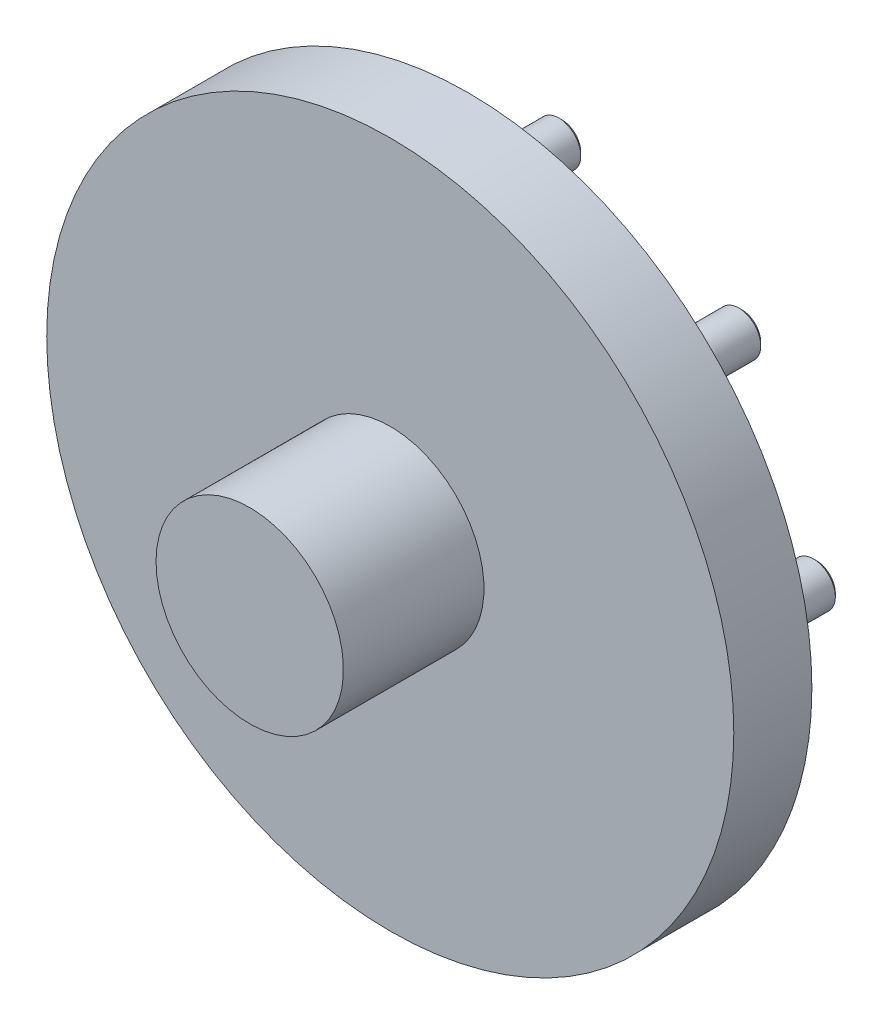
ISO-10303-21;
HEADER;
FILE_DESCRIPTION(('STEP AP214'),'2;1');
FILE_NAME('part.step','',(''),(''),'','','');
FILE_SCHEMA(('AUTOMOTIVE_DESIGN { 1 0 10303 214 1 1 1 1 }'));
ENDSEC;
DATA;
#1=APPLICATION_CONTEXT('core data for automotive mechanical design processes');
#2=APPLICATION_PROTOCOL_DEFINITION('international standard','automotive_design',2000,#1);
#3=PRODUCT_CONTEXT('',#1,'mechanical');
#4=PRODUCT('Part','Part','',(#3));
#5=PRODUCT_RELATED_PRODUCT_CATEGORY('part','',(#4));
#6=PRODUCT_DEFINITION_FORMATION('','',#4);
#7=PRODUCT_DEFINITION_CONTEXT('part definition',#1,'design');
#8=PRODUCT_DEFINITION('design','',#6,#7);
#9=PRODUCT_DEFINITION_SHAPE('','',#8);
#10=(LENGTH_UNIT() NAMED_UNIT(*) SI_UNIT(.MILLI.,.METRE.));
#11=(NAMED_UNIT(*) PLANE_ANGLE_UNIT() SI_UNIT($,.RADIAN.));
#12=(NAMED_UNIT(*) SI_UNIT($,.STERADIAN.) SOLID_ANGLE_UNIT());
#13=UNCERTAINTY_MEASURE_WITH_UNIT(LENGTH_MEASURE(1.E-05),#10,'distance_accuracy_value','');
#14=(GEOMETRIC_REPRESENTATION_CONTEXT(3) GLOBAL_UNCERTAINTY_ASSIGNED_CONTEXT((#13)) GLOBAL_UNIT_ASSIGNED_CONTEXT((#10,
#11,#12)) REPRESENTATION_CONTEXT('',''));
#15=CARTESIAN_POINT('',(0.,0.,0.));
#16=DIRECTION('',(0.,0.,1.));
#17=DIRECTION('',(1.,0.,0.));
#18=AXIS2_PLACEMENT_3D('',#15,#16,#17);
#19=CARTESIAN_POINT('',(53.,0.,4.99999999999995));
#20=DIRECTION('',(0.,0.,-1.));
#21=DIRECTION('',(-1.,0.,0.));
#22=AXIS2_PLACEMENT_3D('',#19,#20,#21);
#23=PLANE('',#22);
#24=CARTESIAN_POINT('',(-81.5,0.,4.99999999999995));
#25=DIRECTION('',(0.,0.,-1.));
#26=DIRECTION('',(-1.,0.,0.));
#27=AXIS2_PLACEMENT_3D('',#24,#25,#26);
#28=CIRCLE('',#27,7.);
#29=CARTESIAN_POINT('',(-88.5,0.,4.99999999999995));
#30=VERTEX_POINT('',#29);
#31=EDGE_CURVE('E124',#30,#30,#28,.T.);
#32=ORIENTED_EDGE('',*,*,#31,.F.);
#33=EDGE_LOOP('',(#32));
#34=FACE_BOUND('',#33,.T.);
#35=CARTESIAN_POINT('',(-57.6292026667036,57.6292026667036,4.99999999999995));
#36=DIRECTION('',(0.,0.,-1.));
#37=DIRECTION('',(-1.,0.,0.));
#38=AXIS2_PLACEMENT_3D('',#35,#36,#37);
#39=CIRCLE('',#38,7.00000000000002);
#40=CARTESIAN_POINT('',(-64.6292026667036,57.6292026667036,4.99999999999995));
#41=VERTEX_POINT('',#40);
#42=EDGE_CURVE('E118',#41,#41,#39,.T.);
#43=ORIENTED_EDGE('',*,*,#42,.F.);
#44=EDGE_LOOP('',(#43));
#45=FACE_BOUND('',#44,.T.);
#46=CARTESIAN_POINT('',(57.6292026667036,57.6292026667036,4.99999999999995));
#47=DIRECTION('',(0.,0.,-1.));
#48=DIRECTION('',(-1.,0.,0.));
#49=AXIS2_PLACEMENT_3D('',#46,#47,#48);
#50=CIRCLE('',#49,7.00000000000001);
#51=CARTESIAN_POINT('',(50.6292026667036,57.6292026667036,4.99999999999995));
#52=VERTEX_POINT('',#51);
#53=EDGE_CURVE('E112',#52,#52,#50,.T.);
#54=ORIENTED_EDGE('',*,*,#53,.F.);
#55=EDGE_LOOP('',(#54));
#56=FACE_BOUND('',#55,.T.);
#57=CARTESIAN_POINT('',(57.6292026667036,-57.6292026667036,4.99999999999995));
#58=DIRECTION('',(0.,0.,-1.));
#59=DIRECTION('',(-1.,0.,0.));
#60=AXIS2_PLACEMENT_3D('',#57,#58,#59);
#61=CIRCLE('',#60,7.00000000000002);
#62=CARTESIAN_POINT('',(50.6292026667036,-57.6292026667036,4.99999999999995));
#63=VERTEX_POINT('',#62);
#64=EDGE_CURVE('E106',#63,#63,#61,.T.);
#65=ORIENTED_EDGE('',*,*,#64,.F.);
#66=EDGE_LOOP('',(#65));
#67=FACE_BOUND('',#66,.T.);
#68=CARTESIAN_POINT('',(0.,0.,4.99999999999989));
#69=DIRECTION('',(0.,0.,-1.));
#70=DIRECTION('',(-1.,0.,0.));
#71=AXIS2_PLACEMENT_3D('',#68,#69,#70);
#72=CIRCLE('',#71,110.);
#73=CARTESIAN_POINT('',(-110.,0.,4.99999999999989));
#74=VERTEX_POINT('',#73);
#75=EDGE_CURVE('E97',#74,#74,#72,.T.);
#76=ORIENTED_EDGE('',*,*,#75,.T.);
#77=EDGE_LOOP('',(#76));
#78=FACE_BOUND('',#77,.T.);
#79=CARTESIAN_POINT('',(0.,0.,5.));
#80=DIRECTION('',(0.,0.,-1.));
#81=DIRECTION('',(-1.,0.,0.));
#82=AXIS2_PLACEMENT_3D('',#79,#80,#81);
#83=CIRCLE('',#82,53.);
#84=CARTESIAN_POINT('',(-53.,0.,5.));
#85=VERTEX_POINT('',#84);
#86=EDGE_CURVE('E94',#85,#85,#83,.T.);
#87=ORIENTED_EDGE('',*,*,#86,.F.);
#88=EDGE_LOOP('',(#87));
#89=FACE_BOUND('',#88,.T.);
#90=CARTESIAN_POINT('',(81.5,0.,4.99999999999995));
#91=DIRECTION('',(0.,0.,-1.));
#92=DIRECTION('',(-1.,0.,0.));
#93=AXIS2_PLACEMENT_3D('',#90,#91,#92);
#94=CIRCLE('',#93,7.);
#95=CARTESIAN_POINT('',(74.5,0.,4.99999999999995));
#96=VERTEX_POINT('',#95);
#97=EDGE_CURVE('E109',#96,#96,#94,.T.);
#98=ORIENTED_EDGE('',*,*,#97,.F.);
#99=EDGE_LOOP('',(#98));
#100=FACE_BOUND('',#99,.T.);
#101=CARTESIAN_POINT('',(0.,81.5,4.99999999999995));
#102=DIRECTION('',(0.,0.,-1.));
#103=DIRECTION('',(-1.,0.,0.));
#104=AXIS2_PLACEMENT_3D('',#101,#102,#103);
#105=CIRCLE('',#104,7.00000000000001);
#106=CARTESIAN_POINT('',(-6.99999999999999,81.5,4.99999999999995));
#107=VERTEX_POINT('',#106);
#108=EDGE_CURVE('E115',#107,#107,#105,.T.);
#109=ORIENTED_EDGE('',*,*,#108,.F.);
#110=EDGE_LOOP('',(#109));
#111=FACE_BOUND('',#110,.T.);
#112=CARTESIAN_POINT('',(0.,-81.5,4.99999999999995));
#113=DIRECTION('',(0.,0.,-1.));
#114=DIRECTION('',(-1.,0.,0.));
#115=AXIS2_PLACEMENT_3D('',#112,#113,#114);
#116=CIRCLE('',#115,7.00000000000001);
#117=CARTESIAN_POINT('',(-7.00000000000002,-81.5,4.99999999999995));
#118=VERTEX_POINT('',#117);
#119=EDGE_CURVE('E121',#118,#118,#116,.T.);
#120=ORIENTED_EDGE('',*,*,#119,.F.);
#121=EDGE_LOOP('',(#120));
#122=FACE_BOUND('',#121,.T.);
#123=CARTESIAN_POINT('',(-57.6292026667036,-57.6292026667036,4.99999999999995));
#124=DIRECTION('',(0.,0.,-1.));
#125=DIRECTION('',(-1.,0.,0.));
#126=AXIS2_PLACEMENT_3D('',#123,#124,#125);
#127=CIRCLE('',#126,7.);
#128=CARTESIAN_POINT('',(-64.6292026667036,-57.6292026667036,4.99999999999995));
#129=VERTEX_POINT('',#128);
#130=EDGE_CURVE('E127',#129,#129,#127,.T.);
#131=ORIENTED_EDGE('',*,*,#130,.F.);
#132=EDGE_LOOP('',(#131));
#133=FACE_BOUND('',#132,.T.);
#134=ADVANCED_FACE('F32',(#34,#45,#56,#67,#78,#89,#100,#111,#122,#133),#23,.T.);
#135=CARTESIAN_POINT('',(0.,0.,75.));
#136=DIRECTION('',(0.,0.,-1.));
#137=DIRECTION('',(-1.,0.,0.));
#138=AXIS2_PLACEMENT_3D('',#135,#136,#137);
#139=CYLINDRICAL_SURFACE('',#138,30.);
#140=CARTESIAN_POINT('',(0.,0.,75.));
#141=DIRECTION('',(0.,0.,-1.));
#142=DIRECTION('',(-1.,0.,0.));
#143=AXIS2_PLACEMENT_3D('',#140,#141,#142);
#144=CIRCLE('',#143,30.);
#145=CARTESIAN_POINT('',(-30.,0.,75.));
#146=VERTEX_POINT('',#145);
#147=EDGE_CURVE('E88',#146,#146,#144,.T.);
#148=ORIENTED_EDGE('',*,*,#147,.T.);
#149=EDGE_LOOP('',(#148));
#150=FACE_BOUND('',#149,.T.);
#151=CARTESIAN_POINT('',(0.,0.,29.9999999999999));
#152=DIRECTION('',(0.,0.,-1.));
#153=DIRECTION('',(-1.,0.,0.));
#154=AXIS2_PLACEMENT_3D('',#151,#152,#153);
#155=CIRCLE('',#154,30.);
#156=CARTESIAN_POINT('',(-30.,0.,29.9999999999999));
#157=VERTEX_POINT('',#156);
#158=EDGE_CURVE('E103',#157,#157,#155,.T.);
#159=ORIENTED_EDGE('',*,*,#158,.F.);
#160=EDGE_LOOP('',(#159));
#161=FACE_BOUND('',#160,.T.);
#162=ADVANCED_FACE('F134',(#150,#161),#139,.T.);
#163=CARTESIAN_POINT('',(30.,0.,75.));
#164=DIRECTION('',(0.,0.,1.));
#165=DIRECTION('',(1.,0.,0.));
#166=AXIS2_PLACEMENT_3D('',#163,#164,#165);
#167=PLANE('',#166);
#168=ORIENTED_EDGE('',*,*,#147,.F.);
#169=EDGE_LOOP('',(#168));
#170=FACE_BOUND('',#169,.T.);
#171=ADVANCED_FACE('F140',(#170),#167,.T.);
#172=CARTESIAN_POINT('',(0.,0.,0.));
#173=DIRECTION('',(0.,0.,-1.));
#174=DIRECTION('',(-1.,0.,0.));
#175=AXIS2_PLACEMENT_3D('',#172,#173,#174);
#176=PLANE('',#175);
#177=CARTESIAN_POINT('',(0.,0.,0.));
#178=DIRECTION('',(0.,0.,-1.));
#179=DIRECTION('',(-1.,0.,0.));
#180=AXIS2_PLACEMENT_3D('',#177,#178,#179);
#181=CIRCLE('',#180,53.);
#182=CARTESIAN_POINT('',(-53.,0.,0.));
#183=VERTEX_POINT('',#182);
#184=EDGE_CURVE('E91',#183,#183,#181,.T.);
#185=ORIENTED_EDGE('',*,*,#184,.T.);
#186=EDGE_LOOP('',(#185));
#187=FACE_BOUND('',#186,.T.);
#188=ADVANCED_FACE('F152',(#187),#176,.T.);
#189=CARTESIAN_POINT('',(0.,0.,75.));
#190=DIRECTION('',(0.,0.,-1.));
#191=DIRECTION('',(-1.,0.,0.));
#192=AXIS2_PLACEMENT_3D('',#189,#190,#191);
#193=CYLINDRICAL_SURFACE('',#192,53.);
#194=ORIENTED_EDGE('',*,*,#86,.T.);
#195=EDGE_LOOP('',(#194));
#196=FACE_BOUND('',#195,.T.);
#197=ORIENTED_EDGE('',*,*,#184,.F.);
#198=EDGE_LOOP('',(#197));
#199=FACE_BOUND('',#198,.T.);
#200=ADVANCED_FACE('F149',(#196,#199),#193,.T.);
#201=CARTESIAN_POINT('',(0.,0.,75.));
#202=DIRECTION('',(0.,0.,-1.));
#203=DIRECTION('',(-1.,0.,0.));
#204=AXIS2_PLACEMENT_3D('',#201,#202,#203);
#205=CYLINDRICAL_SURFACE('',#204,110.);
#206=CARTESIAN_POINT('',(0.,0.,29.9999999999999));
#207=DIRECTION('',(0.,0.,-1.));
#208=DIRECTION('',(-1.,0.,0.));
#209=AXIS2_PLACEMENT_3D('',#206,#207,#208);
#210=CIRCLE('',#209,110.);
#211=CARTESIAN_POINT('',(-110.,0.,29.9999999999999));
#212=VERTEX_POINT('',#211);
#213=EDGE_CURVE('E100',#212,#212,#210,.T.);
#214=ORIENTED_EDGE('',*,*,#213,.T.);
#215=EDGE_LOOP('',(#214));
#216=FACE_BOUND('',#215,.T.);
#217=ORIENTED_EDGE('',*,*,#75,.F.);
#218=EDGE_LOOP('',(#217));
#219=FACE_BOUND('',#218,.T.);
#220=ADVANCED_FACE('F147',(#216,#219),#205,.T.);
#221=CARTESIAN_POINT('',(110.,0.,29.9999999999999));
#222=DIRECTION('',(0.,0.,1.));
#223=DIRECTION('',(1.,0.,0.));
#224=AXIS2_PLACEMENT_3D('',#221,#222,#223);
#225=PLANE('',#224);
#226=ORIENTED_EDGE('',*,*,#158,.T.);
#227=EDGE_LOOP('',(#226));
#228=FACE_BOUND('',#227,.T.);
#229=ORIENTED_EDGE('',*,*,#213,.F.);
#230=EDGE_LOOP('',(#229));
#231=FACE_BOUND('',#230,.T.);
#232=ADVANCED_FACE('F239',(#228,#231),#225,.T.);
#233=CARTESIAN_POINT('',(57.6292026667036,-57.6292026667036,-25.));
#234=DIRECTION('',(0.,0.,1.));
#235=DIRECTION('',(1.,0.,0.));
#236=AXIS2_PLACEMENT_3D('',#233,#234,#235);
#237=CYLINDRICAL_SURFACE('',#236,7.00000000000002);
#238=CARTESIAN_POINT('',(57.6292026667036,-57.6292026667036,-24.));
#239=DIRECTION('',(0.,0.,-1.));
#240=DIRECTION('',(-1.,0.,0.));
#241=AXIS2_PLACEMENT_3D('',#238,#239,#240);
#242=CIRCLE('',#241,7.00000000000002);
#243=CARTESIAN_POINT('',(50.6292026667036,-57.6292026667036,-24.));
#244=VERTEX_POINT('',#243);
#245=EDGE_CURVE('E64',#244,#244,#242,.F.);
#246=ORIENTED_EDGE('',*,*,#245,.T.);
#247=EDGE_LOOP('',(#246));
#248=FACE_BOUND('',#247,.T.);
#249=ORIENTED_EDGE('',*,*,#64,.T.);
#250=EDGE_LOOP('',(#249));
#251=FACE_BOUND('',#250,.T.);
#252=ADVANCED_FACE('F236',(#248,#251),#237,.T.);
#253=CARTESIAN_POINT('',(57.6292026667036,-57.6292026667036,-25.));
#254=DIRECTION('',(0.,0.,-1.));
#255=DIRECTION('',(-1.,0.,0.));
#256=AXIS2_PLACEMENT_3D('',#253,#254,#255);
#257=PLANE('',#256);
#258=CARTESIAN_POINT('',(57.6292026667036,-57.6292026667036,-25.));
#259=DIRECTION('',(0.,0.,-1.));
#260=DIRECTION('',(-1.,0.,0.));
#261=AXIS2_PLACEMENT_3D('',#258,#259,#260);
#262=CIRCLE('',#261,5.99999999999997);
#263=CARTESIAN_POINT('',(51.6292026667036,-57.6292026667036,-25.));
#264=VERTEX_POINT('',#263);
#265=EDGE_CURVE('E67',#264,#264,#262,.T.);
#266=ORIENTED_EDGE('',*,*,#265,.T.);
#267=EDGE_LOOP('',(#266));
#268=FACE_BOUND('',#267,.T.);
#269=ADVANCED_FACE('F232',(#268),#257,.T.);
#270=CARTESIAN_POINT('',(81.5,0.,-25.));
#271=DIRECTION('',(0.,0.,1.));
#272=DIRECTION('',(1.,0.,0.));
#273=AXIS2_PLACEMENT_3D('',#270,#271,#272);
#274=CYLINDRICAL_SURFACE('',#273,7.);
#275=CARTESIAN_POINT('',(81.5,0.,-24.));
#276=DIRECTION('',(0.,0.,-1.));
#277=DIRECTION('',(-1.,0.,0.));
#278=AXIS2_PLACEMENT_3D('',#275,#276,#277);
#279=CIRCLE('',#278,7.);
#280=CARTESIAN_POINT('',(74.5,0.,-24.));
#281=VERTEX_POINT('',#280);
#282=EDGE_CURVE('E70',#281,#281,#279,.F.);
#283=ORIENTED_EDGE('',*,*,#282,.T.);
#284=EDGE_LOOP('',(#283));
#285=FACE_BOUND('',#284,.T.);
#286=ORIENTED_EDGE('',*,*,#97,.T.);
#287=EDGE_LOOP('',(#286));
#288=FACE_BOUND('',#287,.T.);
#289=ADVANCED_FACE('F228',(#285,#288),#274,.T.);
#290=CARTESIAN_POINT('',(81.5,0.,-25.));
#291=DIRECTION('',(0.,0.,-1.));
#292=DIRECTION('',(-1.,0.,0.));
#293=AXIS2_PLACEMENT_3D('',#290,#291,#292);
#294=PLANE('',#293);
#295=CARTESIAN_POINT('',(81.5,0.,-25.));
#296=DIRECTION('',(0.,0.,-1.));
#297=DIRECTION('',(-1.,0.,0.));
#298=AXIS2_PLACEMENT_3D('',#295,#296,#297);
#299=CIRCLE('',#298,5.99999999999998);
#300=CARTESIAN_POINT('',(75.5,0.,-25.));
#301=VERTEX_POINT('',#300);
#302=EDGE_CURVE('E73',#301,#301,#299,.T.);
#303=ORIENTED_EDGE('',*,*,#302,.T.);
#304=EDGE_LOOP('',(#303));
#305=FACE_BOUND('',#304,.T.);
#306=ADVANCED_FACE('F224',(#305),#294,.T.);
#307=CARTESIAN_POINT('',(57.6292026667036,57.6292026667036,-25.));
#308=DIRECTION('',(0.,0.,1.));
#309=DIRECTION('',(1.,0.,0.));
#310=AXIS2_PLACEMENT_3D('',#307,#308,#309);
#311=CYLINDRICAL_SURFACE('',#310,7.00000000000001);
#312=CARTESIAN_POINT('',(57.6292026667036,57.6292026667036,-24.));
#313=DIRECTION('',(0.,0.,-1.));
#314=DIRECTION('',(-1.,0.,0.));
#315=AXIS2_PLACEMENT_3D('',#312,#313,#314);
#316=CIRCLE('',#315,7.00000000000001);
#317=CARTESIAN_POINT('',(50.6292026667036,57.6292026667036,-24.));
#318=VERTEX_POINT('',#317);
#319=EDGE_CURVE('E76',#318,#318,#316,.F.);
#320=ORIENTED_EDGE('',*,*,#319,.T.);
#321=EDGE_LOOP('',(#320));
#322=FACE_BOUND('',#321,.T.);
#323=ORIENTED_EDGE('',*,*,#53,.T.);
#324=EDGE_LOOP('',(#323));
#325=FACE_BOUND('',#324,.T.);
#326=ADVANCED_FACE('F220',(#322,#325),#311,.T.);
#327=CARTESIAN_POINT('',(57.6292026667036,57.6292026667036,-25.));
#328=DIRECTION('',(0.,0.,-1.));
#329=DIRECTION('',(-1.,0.,0.));
#330=AXIS2_PLACEMENT_3D('',#327,#328,#329);
#331=PLANE('',#330);
#332=CARTESIAN_POINT('',(57.6292026667036,57.6292026667036,-25.));
#333=DIRECTION('',(0.,0.,-1.));
#334=DIRECTION('',(-1.,0.,0.));
#335=AXIS2_PLACEMENT_3D('',#332,#333,#334);
#336=CIRCLE('',#335,5.99999999999998);
#337=CARTESIAN_POINT('',(51.6292026667037,57.6292026667036,-25.));
#338=VERTEX_POINT('',#337);
#339=EDGE_CURVE('E79',#338,#338,#336,.T.);
#340=ORIENTED_EDGE('',*,*,#339,.T.);
#341=EDGE_LOOP('',(#340));
#342=FACE_BOUND('',#341,.T.);
#343=ADVANCED_FACE('F217',(#342),#331,.T.);
#344=CARTESIAN_POINT('',(0.,81.5,-25.));
#345=DIRECTION('',(0.,0.,1.));
#346=DIRECTION('',(1.,0.,0.));
#347=AXIS2_PLACEMENT_3D('',#344,#345,#346);
#348=CYLINDRICAL_SURFACE('',#347,7.00000000000001);
#349=CARTESIAN_POINT('',(0.,81.5,-24.));
#350=DIRECTION('',(0.,0.,-1.));
#351=DIRECTION('',(-1.,0.,0.));
#352=AXIS2_PLACEMENT_3D('',#349,#350,#351);
#353=CIRCLE('',#352,7.00000000000001);
#354=CARTESIAN_POINT('',(-6.99999999999999,81.5,-24.));
#355=VERTEX_POINT('',#354);
#356=EDGE_CURVE('E10',#355,#355,#353,.F.);
#357=ORIENTED_EDGE('',*,*,#356,.T.);
#358=EDGE_LOOP('',(#357));
#359=FACE_BOUND('',#358,.T.);
#360=ORIENTED_EDGE('',*,*,#108,.T.);
#361=EDGE_LOOP('',(#360));
#362=FACE_BOUND('',#361,.T.);
#363=ADVANCED_FACE('F214',(#359,#362),#348,.T.);
#364=CARTESIAN_POINT('',(0.,81.5,-25.));
#365=DIRECTION('',(0.,0.,-1.));
#366=DIRECTION('',(-1.,0.,0.));
#367=AXIS2_PLACEMENT_3D('',#364,#365,#366);
#368=PLANE('',#367);
#369=CARTESIAN_POINT('',(0.,81.5,-25.));
#370=DIRECTION('',(0.,0.,-1.));
#371=DIRECTION('',(-1.,0.,0.));
#372=AXIS2_PLACEMENT_3D('',#369,#370,#371);
#373=CIRCLE('',#372,5.99999999999998);
#374=CARTESIAN_POINT('',(-5.99999999999995,81.5,-25.));
#375=VERTEX_POINT('',#374);
#376=EDGE_CURVE('E39',#375,#375,#373,.T.);
#377=ORIENTED_EDGE('',*,*,#376,.T.);
#378=EDGE_LOOP('',(#377));
#379=FACE_BOUND('',#378,.T.);
#380=ADVANCED_FACE('F207',(#379),#368,.T.);
#381=CARTESIAN_POINT('',(-57.6292026667036,57.6292026667036,-25.));
#382=DIRECTION('',(0.,0.,1.));
#383=DIRECTION('',(1.,0.,0.));
#384=AXIS2_PLACEMENT_3D('',#381,#382,#383);
#385=CYLINDRICAL_SURFACE('',#384,7.00000000000002);
#386=CARTESIAN_POINT('',(-57.6292026667036,57.6292026667036,-24.));
#387=DIRECTION('',(0.,0.,-1.));
#388=DIRECTION('',(-1.,0.,0.));
#389=AXIS2_PLACEMENT_3D('',#386,#387,#388);
#390=CIRCLE('',#389,7.00000000000002);
#391=CARTESIAN_POINT('',(-64.6292026667036,57.6292026667036,-24.));
#392=VERTEX_POINT('',#391);
#393=EDGE_CURVE('E43',#392,#392,#390,.F.);
#394=ORIENTED_EDGE('',*,*,#393,.T.);
#395=EDGE_LOOP('',(#394));
#396=FACE_BOUND('',#395,.T.);
#397=ORIENTED_EDGE('',*,*,#42,.T.);
#398=EDGE_LOOP('',(#397));
#399=FACE_BOUND('',#398,.T.);
#400=ADVANCED_FACE('F198',(#396,#399),#385,.T.);
#401=CARTESIAN_POINT('',(-57.6292026667036,57.6292026667036,-25.));
#402=DIRECTION('',(0.,0.,-1.));
#403=DIRECTION('',(-1.,0.,0.));
#404=AXIS2_PLACEMENT_3D('',#401,#402,#403);
#405=PLANE('',#404);
#406=CARTESIAN_POINT('',(-57.6292026667036,57.6292026667036,-25.));
#407=DIRECTION('',(0.,0.,-1.));
#408=DIRECTION('',(-1.,0.,0.));
#409=AXIS2_PLACEMENT_3D('',#406,#407,#408);
#410=CIRCLE('',#409,5.99999999999996);
#411=CARTESIAN_POINT('',(-63.6292026667036,57.6292026667036,-25.));
#412=VERTEX_POINT('',#411);
#413=EDGE_CURVE('E47',#412,#412,#410,.T.);
#414=ORIENTED_EDGE('',*,*,#413,.T.);
#415=EDGE_LOOP('',(#414));
#416=FACE_BOUND('',#415,.T.);
#417=ADVANCED_FACE('F195',(#416),#405,.T.);
#418=CARTESIAN_POINT('',(0.,-81.5,-25.));
#419=DIRECTION('',(0.,0.,1.));
#420=DIRECTION('',(1.,0.,0.));
#421=AXIS2_PLACEMENT_3D('',#418,#419,#420);
#422=CYLINDRICAL_SURFACE('',#421,7.00000000000001);
#423=CARTESIAN_POINT('',(0.,-81.5,-24.));
#424=DIRECTION('',(0.,0.,-1.));
#425=DIRECTION('',(-1.,0.,0.));
#426=AXIS2_PLACEMENT_3D('',#423,#424,#425);
#427=CIRCLE('',#426,7.00000000000001);
#428=CARTESIAN_POINT('',(-7.00000000000002,-81.5,-24.));
#429=VERTEX_POINT('',#428);
#430=EDGE_CURVE('E58',#429,#429,#427,.F.);
#431=ORIENTED_EDGE('',*,*,#430,.T.);
#432=EDGE_LOOP('',(#431));
#433=FACE_BOUND('',#432,.T.);
#434=ORIENTED_EDGE('',*,*,#119,.T.);
#435=EDGE_LOOP('',(#434));
#436=FACE_BOUND('',#435,.T.);
#437=ADVANCED_FACE('F197',(#433,#436),#422,.T.);
#438=CARTESIAN_POINT('',(0.,-81.5,-25.));
#439=DIRECTION('',(0.,0.,-1.));
#440=DIRECTION('',(-1.,0.,0.));
#441=AXIS2_PLACEMENT_3D('',#438,#439,#440);
#442=PLANE('',#441);
#443=CARTESIAN_POINT('',(0.,-81.5,-25.));
#444=DIRECTION('',(0.,0.,-1.));
#445=DIRECTION('',(-1.,0.,0.));
#446=AXIS2_PLACEMENT_3D('',#443,#444,#445);
#447=CIRCLE('',#446,5.99999999999998);
#448=CARTESIAN_POINT('',(-5.99999999999999,-81.5,-25.));
#449=VERTEX_POINT('',#448);
#450=EDGE_CURVE('E61',#449,#449,#447,.T.);
#451=ORIENTED_EDGE('',*,*,#450,.T.);
#452=EDGE_LOOP('',(#451));
#453=FACE_BOUND('',#452,.T.);
#454=ADVANCED_FACE('F204',(#453),#442,.T.);
#455=CARTESIAN_POINT('',(-81.5,0.,-25.));
#456=DIRECTION('',(0.,0.,1.));
#457=DIRECTION('',(1.,0.,0.));
#458=AXIS2_PLACEMENT_3D('',#455,#456,#457);
#459=CYLINDRICAL_SURFACE('',#458,7.);
#460=CARTESIAN_POINT('',(-81.5,0.,-24.));
#461=DIRECTION('',(0.,0.,-1.));
#462=DIRECTION('',(-1.,0.,0.));
#463=AXIS2_PLACEMENT_3D('',#460,#461,#462);
#464=CIRCLE('',#463,7.);
#465=CARTESIAN_POINT('',(-88.5,0.,-24.));
#466=VERTEX_POINT('',#465);
#467=EDGE_CURVE('E82',#466,#466,#464,.F.);
#468=ORIENTED_EDGE('',*,*,#467,.T.);
#469=EDGE_LOOP('',(#468));
#470=FACE_BOUND('',#469,.T.);
#471=ORIENTED_EDGE('',*,*,#31,.T.);
#472=EDGE_LOOP('',(#471));
#473=FACE_BOUND('',#472,.T.);
#474=ADVANCED_FACE('F365',(#470,#473),#459,.T.);
#475=CARTESIAN_POINT('',(-81.5,0.,-25.));
#476=DIRECTION('',(0.,0.,-1.));
#477=DIRECTION('',(-1.,0.,0.));
#478=AXIS2_PLACEMENT_3D('',#475,#476,#477);
#479=PLANE('',#478);
#480=CARTESIAN_POINT('',(-81.5,0.,-25.));
#481=DIRECTION('',(0.,0.,-1.));
#482=DIRECTION('',(-1.,0.,0.));
#483=AXIS2_PLACEMENT_3D('',#480,#481,#482);
#484=CIRCLE('',#483,5.99999999999998);
#485=CARTESIAN_POINT('',(-87.5,0.,-25.));
#486=VERTEX_POINT('',#485);
#487=EDGE_CURVE('E85',#486,#486,#484,.T.);
#488=ORIENTED_EDGE('',*,*,#487,.T.);
#489=EDGE_LOOP('',(#488));
#490=FACE_BOUND('',#489,.T.);
#491=ADVANCED_FACE('F373',(#490),#479,.T.);
#492=CARTESIAN_POINT('',(-57.6292026667036,-57.6292026667036,-25.));
#493=DIRECTION('',(0.,0.,1.));
#494=DIRECTION('',(1.,0.,0.));
#495=AXIS2_PLACEMENT_3D('',#492,#493,#494);
#496=CYLINDRICAL_SURFACE('',#495,7.);
#497=CARTESIAN_POINT('',(-57.6292026667036,-57.6292026667036,-24.));
#498=DIRECTION('',(0.,0.,-1.));
#499=DIRECTION('',(-1.,0.,0.));
#500=AXIS2_PLACEMENT_3D('',#497,#498,#499);
#501=CIRCLE('',#500,7.);
#502=CARTESIAN_POINT('',(-64.6292026667036,-57.6292026667036,-24.));
#503=VERTEX_POINT('',#502);
#504=EDGE_CURVE('E52',#503,#503,#501,.F.);
#505=ORIENTED_EDGE('',*,*,#504,.T.);
#506=EDGE_LOOP('',(#505));
#507=FACE_BOUND('',#506,.T.);
#508=ORIENTED_EDGE('',*,*,#130,.T.);
#509=EDGE_LOOP('',(#508));
#510=FACE_BOUND('',#509,.T.);
#511=ADVANCED_FACE('F131',(#507,#510),#496,.T.);
#512=CARTESIAN_POINT('',(-57.6292026667036,-57.6292026667036,-25.));
#513=DIRECTION('',(0.,0.,-1.));
#514=DIRECTION('',(-1.,0.,0.));
#515=AXIS2_PLACEMENT_3D('',#512,#513,#514);
#516=PLANE('',#515);
#517=CARTESIAN_POINT('',(-57.6292026667036,-57.6292026667036,-25.));
#518=DIRECTION('',(0.,0.,-1.));
#519=DIRECTION('',(-1.,0.,0.));
#520=AXIS2_PLACEMENT_3D('',#517,#518,#519);
#521=CIRCLE('',#520,5.99999999999998);
#522=CARTESIAN_POINT('',(-63.6292026667036,-57.6292026667036,-25.));
#523=VERTEX_POINT('',#522);
#524=EDGE_CURVE('E55',#523,#523,#521,.T.);
#525=ORIENTED_EDGE('',*,*,#524,.T.);
#526=EDGE_LOOP('',(#525));
#527=FACE_BOUND('',#526,.T.);
#528=ADVANCED_FACE('F164',(#527),#516,.T.);
#529=CARTESIAN_POINT('',(-81.5,0.,-25.));
#530=DIRECTION('',(0.,0.,1.));
#531=DIRECTION('',(1.,0.,0.));
#532=AXIS2_PLACEMENT_3D('',#529,#530,#531);
#533=CONICAL_SURFACE('',#532,5.99999999999998,0.785398163397473);
#534=ORIENTED_EDGE('',*,*,#467,.F.);
#535=EDGE_LOOP('',(#534));
#536=FACE_BOUND('',#535,.T.);
#537=ORIENTED_EDGE('',*,*,#487,.F.);
#538=EDGE_LOOP('',(#537));
#539=FACE_BOUND('',#538,.T.);
#540=ADVANCED_FACE('F160',(#536,#539),#533,.T.);
#541=CARTESIAN_POINT('',(57.6292026667036,57.6292026667036,-25.));
#542=DIRECTION('',(0.,0.,1.));
#543=DIRECTION('',(1.,0.,0.));
#544=AXIS2_PLACEMENT_3D('',#541,#542,#543);
#545=CONICAL_SURFACE('',#544,5.99999999999998,0.785398163397472);
#546=ORIENTED_EDGE('',*,*,#319,.F.);
#547=EDGE_LOOP('',(#546));
#548=FACE_BOUND('',#547,.T.);
#549=ORIENTED_EDGE('',*,*,#339,.F.);
#550=EDGE_LOOP('',(#549));
#551=FACE_BOUND('',#550,.T.);
#552=ADVANCED_FACE('F163',(#548,#551),#545,.T.);
#553=CARTESIAN_POINT('',(81.5,0.,-25.));
#554=DIRECTION('',(0.,0.,1.));
#555=DIRECTION('',(1.,0.,0.));
#556=AXIS2_PLACEMENT_3D('',#553,#554,#555);
#557=CONICAL_SURFACE('',#556,5.99999999999998,0.785398163397473);
#558=ORIENTED_EDGE('',*,*,#282,.F.);
#559=EDGE_LOOP('',(#558));
#560=FACE_BOUND('',#559,.T.);
#561=ORIENTED_EDGE('',*,*,#302,.F.);
#562=EDGE_LOOP('',(#561));
#563=FACE_BOUND('',#562,.T.);
#564=ADVANCED_FACE('F168',(#560,#563),#557,.T.);
#565=CARTESIAN_POINT('',(57.6292026667036,-57.6292026667036,-25.));
#566=DIRECTION('',(0.,0.,1.));
#567=DIRECTION('',(1.,0.,0.));
#568=AXIS2_PLACEMENT_3D('',#565,#566,#567);
#569=CONICAL_SURFACE('',#568,5.99999999999997,0.785398163397476);
#570=ORIENTED_EDGE('',*,*,#245,.F.);
#571=EDGE_LOOP('',(#570));
#572=FACE_BOUND('',#571,.T.);
#573=ORIENTED_EDGE('',*,*,#265,.F.);
#574=EDGE_LOOP('',(#573));
#575=FACE_BOUND('',#574,.T.);
#576=ADVANCED_FACE('F172',(#572,#575),#569,.T.);
#577=CARTESIAN_POINT('',(0.,-81.5,-25.));
#578=DIRECTION('',(0.,0.,1.));
#579=DIRECTION('',(1.,0.,0.));
#580=AXIS2_PLACEMENT_3D('',#577,#578,#579);
#581=CONICAL_SURFACE('',#580,5.99999999999998,0.785398163397473);
#582=ORIENTED_EDGE('',*,*,#430,.F.);
#583=EDGE_LOOP('',(#582));
#584=FACE_BOUND('',#583,.T.);
#585=ORIENTED_EDGE('',*,*,#450,.F.);
#586=EDGE_LOOP('',(#585));
#587=FACE_BOUND('',#586,.T.);
#588=ADVANCED_FACE('F176',(#584,#587),#581,.T.);
#589=CARTESIAN_POINT('',(-57.6292026667036,-57.6292026667036,-25.));
#590=DIRECTION('',(0.,0.,1.));
#591=DIRECTION('',(1.,0.,0.));
#592=AXIS2_PLACEMENT_3D('',#589,#590,#591);
#593=CONICAL_SURFACE('',#592,5.99999999999998,0.785398163397474);
#594=ORIENTED_EDGE('',*,*,#504,.F.);
#595=EDGE_LOOP('',(#594));
#596=FACE_BOUND('',#595,.T.);
#597=ORIENTED_EDGE('',*,*,#524,.F.);
#598=EDGE_LOOP('',(#597));
#599=FACE_BOUND('',#598,.T.);
#600=ADVANCED_FACE('F180',(#596,#599),#593,.T.);
#601=CARTESIAN_POINT('',(-57.6292026667036,57.6292026667036,-25.));
#602=DIRECTION('',(0.,0.,1.));
#603=DIRECTION('',(1.,0.,0.));
#604=AXIS2_PLACEMENT_3D('',#601,#602,#603);
#605=CONICAL_SURFACE('',#604,5.99999999999997,0.785398163397476);
#606=ORIENTED_EDGE('',*,*,#393,.F.);
#607=EDGE_LOOP('',(#606));
#608=FACE_BOUND('',#607,.T.);
#609=ORIENTED_EDGE('',*,*,#413,.F.);
#610=EDGE_LOOP('',(#609));
#611=FACE_BOUND('',#610,.T.);
#612=ADVANCED_FACE('F183',(#608,#611),#605,.T.);
#613=CARTESIAN_POINT('',(0.,81.5,-25.));
#614=DIRECTION('',(0.,0.,1.));
#615=DIRECTION('',(1.,0.,0.));
#616=AXIS2_PLACEMENT_3D('',#613,#614,#615);
#617=CONICAL_SURFACE('',#616,5.99999999999998,0.785398163397473);
#618=ORIENTED_EDGE('',*,*,#356,.F.);
#619=EDGE_LOOP('',(#618));
#620=FACE_BOUND('',#619,.T.);
#621=ORIENTED_EDGE('',*,*,#376,.F.);
#622=EDGE_LOOP('',(#621));
#623=FACE_BOUND('',#622,.T.);
#624=ADVANCED_FACE('F34',(#620,#623),#617,.T.);
#625=CLOSED_SHELL('',(#134,#162,#171,#188,#200,#220,#232,#252,#269,#289,#306,#326,#343,#363,
#380,#400,#417,#437,#454,#474,#491,#511,#528,#540,#552,#564,#576,#588,#600,#612,#624));
#626=MANIFOLD_SOLID_BREP('B2',#625);
#627=ADVANCED_BREP_SHAPE_REPRESENTATION('',(#18,#626),#14);
#628=SHAPE_DEFINITION_REPRESENTATION(#9,#627);
ENDSEC;
END-ISO-10303-21;
